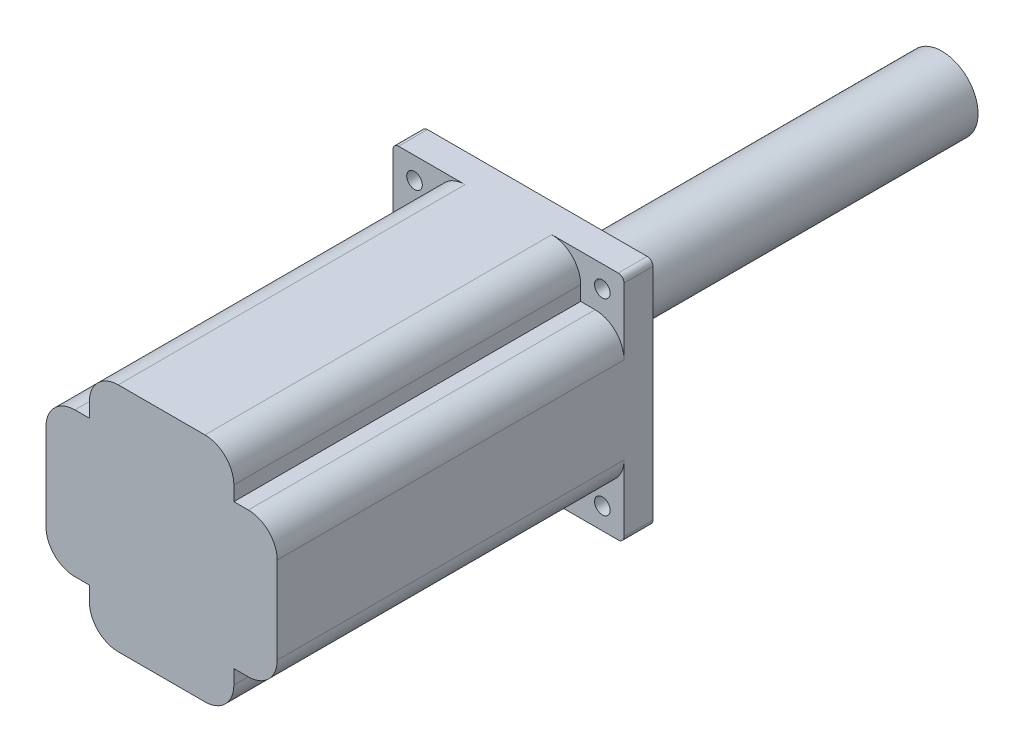
ISO-10303-21;
HEADER;
FILE_DESCRIPTION(('STEP AP214'),'2;1');
FILE_NAME('part.step','',(''),(''),'','','');
FILE_SCHEMA(('AUTOMOTIVE_DESIGN { 1 0 10303 214 1 1 1 1 }'));
ENDSEC;
DATA;
#1=APPLICATION_CONTEXT('core data for automotive mechanical design processes');
#2=APPLICATION_PROTOCOL_DEFINITION('international standard','automotive_design',2000,#1);
#3=PRODUCT_CONTEXT('',#1,'mechanical');
#4=PRODUCT('Part','Part','',(#3));
#5=PRODUCT_RELATED_PRODUCT_CATEGORY('part','',(#4));
#6=PRODUCT_DEFINITION_FORMATION('','',#4);
#7=PRODUCT_DEFINITION_CONTEXT('part definition',#1,'design');
#8=PRODUCT_DEFINITION('design','',#6,#7);
#9=PRODUCT_DEFINITION_SHAPE('','',#8);
#10=(LENGTH_UNIT() NAMED_UNIT(*) SI_UNIT(.MILLI.,.METRE.));
#11=(NAMED_UNIT(*) PLANE_ANGLE_UNIT() SI_UNIT($,.RADIAN.));
#12=(NAMED_UNIT(*) SI_UNIT($,.STERADIAN.) SOLID_ANGLE_UNIT());
#13=UNCERTAINTY_MEASURE_WITH_UNIT(LENGTH_MEASURE(1.E-05),#10,'distance_accuracy_value','');
#14=(GEOMETRIC_REPRESENTATION_CONTEXT(3) GLOBAL_UNCERTAINTY_ASSIGNED_CONTEXT((#13)) GLOBAL_UNIT_ASSIGNED_CONTEXT((#10,
#11,#12)) REPRESENTATION_CONTEXT('',''));
#15=CARTESIAN_POINT('',(0.,0.,0.));
#16=DIRECTION('',(0.,0.,1.));
#17=DIRECTION('',(1.,0.,0.));
#18=AXIS2_PLACEMENT_3D('',#15,#16,#17);
#19=CARTESIAN_POINT('',(-32.5,32.5,130.));
#20=DIRECTION('',(0.,0.,-1.));
#21=DIRECTION('',(-1.,0.,0.));
#22=AXIS2_PLACEMENT_3D('',#19,#20,#21);
#23=CYLINDRICAL_SURFACE('',#22,2.7);
#24=CARTESIAN_POINT('',(-32.5,32.5,0.));
#25=DIRECTION('',(0.,0.,1.));
#26=DIRECTION('',(1.,0.,0.));
#27=AXIS2_PLACEMENT_3D('',#24,#25,#26);
#28=CIRCLE('',#27,2.7);
#29=CARTESIAN_POINT('',(-29.8,32.5,0.));
#30=VERTEX_POINT('',#29);
#31=EDGE_CURVE('E359',#30,#30,#28,.T.);
#32=ORIENTED_EDGE('',*,*,#31,.F.);
#33=EDGE_LOOP('',(#32));
#34=FACE_BOUND('',#33,.T.);
#35=CARTESIAN_POINT('',(-32.5,32.5,9.99999999999999));
#36=DIRECTION('',(0.,0.,1.));
#37=DIRECTION('',(1.,0.,0.));
#38=AXIS2_PLACEMENT_3D('',#35,#36,#37);
#39=CIRCLE('',#38,2.7);
#40=CARTESIAN_POINT('',(-29.8,32.5,9.99999999999999));
#41=VERTEX_POINT('',#40);
#42=EDGE_CURVE('E341',#41,#41,#39,.T.);
#43=ORIENTED_EDGE('',*,*,#42,.T.);
#44=EDGE_LOOP('',(#43));
#45=FACE_BOUND('',#44,.T.);
#46=ADVANCED_FACE('F41',(#34,#45),#23,.F.);
#47=CARTESIAN_POINT('',(32.5,32.5,130.));
#48=DIRECTION('',(0.,0.,-1.));
#49=DIRECTION('',(-1.,0.,0.));
#50=AXIS2_PLACEMENT_3D('',#47,#48,#49);
#51=CYLINDRICAL_SURFACE('',#50,2.7);
#52=CARTESIAN_POINT('',(32.5,32.5,0.));
#53=DIRECTION('',(0.,0.,1.));
#54=DIRECTION('',(1.,0.,0.));
#55=AXIS2_PLACEMENT_3D('',#52,#53,#54);
#56=CIRCLE('',#55,2.7);
#57=CARTESIAN_POINT('',(35.2,32.5,0.));
#58=VERTEX_POINT('',#57);
#59=EDGE_CURVE('E355',#58,#58,#56,.T.);
#60=ORIENTED_EDGE('',*,*,#59,.F.);
#61=EDGE_LOOP('',(#60));
#62=FACE_BOUND('',#61,.T.);
#63=CARTESIAN_POINT('',(32.5,32.5,9.99999999999999));
#64=DIRECTION('',(0.,0.,1.));
#65=DIRECTION('',(1.,0.,0.));
#66=AXIS2_PLACEMENT_3D('',#63,#64,#65);
#67=CIRCLE('',#66,2.7);
#68=CARTESIAN_POINT('',(35.2,32.5,9.99999999999999));
#69=VERTEX_POINT('',#68);
#70=EDGE_CURVE('E399',#69,#69,#67,.T.);
#71=ORIENTED_EDGE('',*,*,#70,.T.);
#72=EDGE_LOOP('',(#71));
#73=FACE_BOUND('',#72,.T.);
#74=ADVANCED_FACE('F592',(#62,#73),#51,.F.);
#75=CARTESIAN_POINT('',(32.5,-32.5,130.));
#76=DIRECTION('',(0.,0.,-1.));
#77=DIRECTION('',(-1.,0.,0.));
#78=AXIS2_PLACEMENT_3D('',#75,#76,#77);
#79=CYLINDRICAL_SURFACE('',#78,2.7);
#80=CARTESIAN_POINT('',(32.5,-32.5,0.));
#81=DIRECTION('',(0.,0.,1.));
#82=DIRECTION('',(1.,0.,0.));
#83=AXIS2_PLACEMENT_3D('',#80,#81,#82);
#84=CIRCLE('',#83,2.7);
#85=CARTESIAN_POINT('',(35.2,-32.5,0.));
#86=VERTEX_POINT('',#85);
#87=EDGE_CURVE('E351',#86,#86,#84,.T.);
#88=ORIENTED_EDGE('',*,*,#87,.F.);
#89=EDGE_LOOP('',(#88));
#90=FACE_BOUND('',#89,.T.);
#91=CARTESIAN_POINT('',(32.5,-32.5,9.99999999999999));
#92=DIRECTION('',(0.,0.,1.));
#93=DIRECTION('',(1.,0.,0.));
#94=AXIS2_PLACEMENT_3D('',#91,#92,#93);
#95=CIRCLE('',#94,2.7);
#96=CARTESIAN_POINT('',(35.2,-32.5,9.99999999999999));
#97=VERTEX_POINT('',#96);
#98=EDGE_CURVE('E395',#97,#97,#95,.T.);
#99=ORIENTED_EDGE('',*,*,#98,.T.);
#100=EDGE_LOOP('',(#99));
#101=FACE_BOUND('',#100,.T.);
#102=ADVANCED_FACE('F598',(#90,#101),#79,.F.);
#103=CARTESIAN_POINT('',(-32.5,-32.5,130.));
#104=DIRECTION('',(0.,0.,-1.));
#105=DIRECTION('',(-1.,0.,0.));
#106=AXIS2_PLACEMENT_3D('',#103,#104,#105);
#107=CYLINDRICAL_SURFACE('',#106,2.7);
#108=CARTESIAN_POINT('',(-32.5,-32.5,0.));
#109=DIRECTION('',(0.,0.,1.));
#110=DIRECTION('',(1.,0.,0.));
#111=AXIS2_PLACEMENT_3D('',#108,#109,#110);
#112=CIRCLE('',#111,2.7);
#113=CARTESIAN_POINT('',(-29.8,-32.5,0.));
#114=VERTEX_POINT('',#113);
#115=EDGE_CURVE('E340',#114,#114,#112,.T.);
#116=ORIENTED_EDGE('',*,*,#115,.F.);
#117=EDGE_LOOP('',(#116));
#118=FACE_BOUND('',#117,.T.);
#119=CARTESIAN_POINT('',(-32.5,-32.5,9.99999999999999));
#120=DIRECTION('',(0.,0.,1.));
#121=DIRECTION('',(1.,0.,0.));
#122=AXIS2_PLACEMENT_3D('',#119,#120,#121);
#123=CIRCLE('',#122,2.7);
#124=CARTESIAN_POINT('',(-29.8,-32.5,9.99999999999999));
#125=VERTEX_POINT('',#124);
#126=EDGE_CURVE('E335',#125,#125,#123,.T.);
#127=ORIENTED_EDGE('',*,*,#126,.T.);
#128=EDGE_LOOP('',(#127));
#129=FACE_BOUND('',#128,.T.);
#130=ADVANCED_FACE('F608',(#118,#129),#107,.F.);
#131=CARTESIAN_POINT('',(0.,0.,130.));
#132=DIRECTION('',(0.,0.,1.));
#133=DIRECTION('',(1.,0.,0.));
#134=AXIS2_PLACEMENT_3D('',#131,#132,#133);
#135=PLANE('',#134);
#136=DIRECTION('',(0.,-1.,0.));
#137=VECTOR('',#136,1.);
#138=CARTESIAN_POINT('',(-40.,40.,130.));
#139=LINE('',#138,#137);
#140=CARTESIAN_POINT('',(-40.,15.,130.));
#141=VERTEX_POINT('',#140);
#142=CARTESIAN_POINT('',(-40.,-15.,130.));
#143=VERTEX_POINT('',#142);
#144=EDGE_CURVE('E372',#141,#143,#139,.T.);
#145=ORIENTED_EDGE('',*,*,#144,.T.);
#146=CARTESIAN_POINT('',(-30.,-15.,130.));
#147=DIRECTION('',(0.,0.,1.));
#148=DIRECTION('',(1.,0.,0.));
#149=AXIS2_PLACEMENT_3D('',#146,#147,#148);
#150=CIRCLE('',#149,10.);
#151=CARTESIAN_POINT('',(-30.,-25.,130.));
#152=VERTEX_POINT('',#151);
#153=EDGE_CURVE('E485',#143,#152,#150,.T.);
#154=ORIENTED_EDGE('',*,*,#153,.T.);
#155=DIRECTION('',(-1.,0.,0.));
#156=VECTOR('',#155,1.);
#157=CARTESIAN_POINT('',(-40.,-25.,130.));
#158=LINE('',#157,#156);
#159=CARTESIAN_POINT('',(-25.,-25.,130.));
#160=VERTEX_POINT('',#159);
#161=EDGE_CURVE('E303',#160,#152,#158,.T.);
#162=ORIENTED_EDGE('',*,*,#161,.F.);
#163=DIRECTION('',(0.,1.,0.));
#164=VECTOR('',#163,1.);
#165=CARTESIAN_POINT('',(-25.,-40.,130.));
#166=LINE('',#165,#164);
#167=CARTESIAN_POINT('',(-25.,-30.,130.));
#168=VERTEX_POINT('',#167);
#169=EDGE_CURVE('E300',#168,#160,#166,.T.);
#170=ORIENTED_EDGE('',*,*,#169,.F.);
#171=CARTESIAN_POINT('',(-15.,-30.,130.));
#172=DIRECTION('',(0.,0.,1.));
#173=DIRECTION('',(1.,0.,0.));
#174=AXIS2_PLACEMENT_3D('',#171,#172,#173);
#175=CIRCLE('',#174,10.);
#176=CARTESIAN_POINT('',(-15.,-40.,130.));
#177=VERTEX_POINT('',#176);
#178=EDGE_CURVE('E482',#168,#177,#175,.T.);
#179=ORIENTED_EDGE('',*,*,#178,.T.);
#180=DIRECTION('',(1.,0.,0.));
#181=VECTOR('',#180,1.);
#182=CARTESIAN_POINT('',(-40.,-40.,130.));
#183=LINE('',#182,#181);
#184=CARTESIAN_POINT('',(15.,-40.,130.));
#185=VERTEX_POINT('',#184);
#186=EDGE_CURVE('E347',#177,#185,#183,.T.);
#187=ORIENTED_EDGE('',*,*,#186,.T.);
#188=CARTESIAN_POINT('',(15.,-30.,130.));
#189=DIRECTION('',(0.,0.,1.));
#190=DIRECTION('',(1.,0.,0.));
#191=AXIS2_PLACEMENT_3D('',#188,#189,#190);
#192=CIRCLE('',#191,10.);
#193=CARTESIAN_POINT('',(25.,-30.,130.));
#194=VERTEX_POINT('',#193);
#195=EDGE_CURVE('E479',#185,#194,#192,.T.);
#196=ORIENTED_EDGE('',*,*,#195,.T.);
#197=DIRECTION('',(0.,-1.,0.));
#198=VECTOR('',#197,1.);
#199=CARTESIAN_POINT('',(25.,-40.,130.));
#200=LINE('',#199,#198);
#201=CARTESIAN_POINT('',(25.,-25.,130.));
#202=VERTEX_POINT('',#201);
#203=EDGE_CURVE('E278',#202,#194,#200,.T.);
#204=ORIENTED_EDGE('',*,*,#203,.F.);
#205=DIRECTION('',(-1.,0.,0.));
#206=VECTOR('',#205,1.);
#207=CARTESIAN_POINT('',(40.,-25.,130.));
#208=LINE('',#207,#206);
#209=CARTESIAN_POINT('',(30.,-25.,130.));
#210=VERTEX_POINT('',#209);
#211=EDGE_CURVE('E275',#210,#202,#208,.T.);
#212=ORIENTED_EDGE('',*,*,#211,.F.);
#213=CARTESIAN_POINT('',(30.,-15.,130.));
#214=DIRECTION('',(0.,0.,1.));
#215=DIRECTION('',(1.,0.,0.));
#216=AXIS2_PLACEMENT_3D('',#213,#214,#215);
#217=CIRCLE('',#216,10.);
#218=CARTESIAN_POINT('',(40.,-15.,130.));
#219=VERTEX_POINT('',#218);
#220=EDGE_CURVE('E476',#210,#219,#217,.T.);
#221=ORIENTED_EDGE('',*,*,#220,.T.);
#222=DIRECTION('',(0.,1.,0.));
#223=VECTOR('',#222,1.);
#224=CARTESIAN_POINT('',(40.,40.,130.));
#225=LINE('',#224,#223);
#226=CARTESIAN_POINT('',(40.,15.,130.));
#227=VERTEX_POINT('',#226);
#228=EDGE_CURVE('E364',#219,#227,#225,.T.);
#229=ORIENTED_EDGE('',*,*,#228,.T.);
#230=CARTESIAN_POINT('',(30.,15.,130.));
#231=DIRECTION('',(0.,0.,1.));
#232=DIRECTION('',(1.,0.,0.));
#233=AXIS2_PLACEMENT_3D('',#230,#231,#232);
#234=CIRCLE('',#233,10.);
#235=CARTESIAN_POINT('',(30.,25.,130.));
#236=VERTEX_POINT('',#235);
#237=EDGE_CURVE('E254',#227,#236,#234,.T.);
#238=ORIENTED_EDGE('',*,*,#237,.T.);
#239=DIRECTION('',(1.,0.,0.));
#240=VECTOR('',#239,1.);
#241=CARTESIAN_POINT('',(40.,25.,130.));
#242=LINE('',#241,#240);
#243=CARTESIAN_POINT('',(25.,25.,130.));
#244=VERTEX_POINT('',#243);
#245=EDGE_CURVE('E240',#244,#236,#242,.T.);
#246=ORIENTED_EDGE('',*,*,#245,.F.);
#247=DIRECTION('',(0.,-1.,0.));
#248=VECTOR('',#247,1.);
#249=CARTESIAN_POINT('',(25.,40.,130.));
#250=LINE('',#249,#248);
#251=CARTESIAN_POINT('',(25.,30.,130.));
#252=VERTEX_POINT('',#251);
#253=EDGE_CURVE('E229',#252,#244,#250,.T.);
#254=ORIENTED_EDGE('',*,*,#253,.F.);
#255=CARTESIAN_POINT('',(15.,30.,130.));
#256=DIRECTION('',(0.,0.,1.));
#257=DIRECTION('',(1.,0.,0.));
#258=AXIS2_PLACEMENT_3D('',#255,#256,#257);
#259=CIRCLE('',#258,10.);
#260=CARTESIAN_POINT('',(15.,40.,130.));
#261=VERTEX_POINT('',#260);
#262=EDGE_CURVE('E471',#252,#261,#259,.T.);
#263=ORIENTED_EDGE('',*,*,#262,.T.);
#264=DIRECTION('',(-1.,0.,0.));
#265=VECTOR('',#264,1.);
#266=CARTESIAN_POINT('',(-40.,40.,130.));
#267=LINE('',#266,#265);
#268=CARTESIAN_POINT('',(-15.,40.,130.));
#269=VERTEX_POINT('',#268);
#270=EDGE_CURVE('E367',#261,#269,#267,.T.);
#271=ORIENTED_EDGE('',*,*,#270,.T.);
#272=CARTESIAN_POINT('',(-15.,30.,130.));
#273=DIRECTION('',(0.,0.,1.));
#274=DIRECTION('',(1.,0.,0.));
#275=AXIS2_PLACEMENT_3D('',#272,#273,#274);
#276=CIRCLE('',#275,10.);
#277=CARTESIAN_POINT('',(-25.,30.,130.));
#278=VERTEX_POINT('',#277);
#279=EDGE_CURVE('E465',#269,#278,#276,.T.);
#280=ORIENTED_EDGE('',*,*,#279,.T.);
#281=DIRECTION('',(0.,1.,0.));
#282=VECTOR('',#281,1.);
#283=CARTESIAN_POINT('',(-25.,40.,130.));
#284=LINE('',#283,#282);
#285=CARTESIAN_POINT('',(-25.,25.,130.));
#286=VERTEX_POINT('',#285);
#287=EDGE_CURVE('E327',#286,#278,#284,.T.);
#288=ORIENTED_EDGE('',*,*,#287,.F.);
#289=DIRECTION('',(1.,0.,0.));
#290=VECTOR('',#289,1.);
#291=CARTESIAN_POINT('',(-40.,25.,130.));
#292=LINE('',#291,#290);
#293=CARTESIAN_POINT('',(-30.,25.,130.));
#294=VERTEX_POINT('',#293);
#295=EDGE_CURVE('E262',#294,#286,#292,.T.);
#296=ORIENTED_EDGE('',*,*,#295,.F.);
#297=CARTESIAN_POINT('',(-30.,15.,130.));
#298=DIRECTION('',(0.,0.,1.));
#299=DIRECTION('',(1.,0.,0.));
#300=AXIS2_PLACEMENT_3D('',#297,#298,#299);
#301=CIRCLE('',#300,10.);
#302=EDGE_CURVE('E468',#294,#141,#301,.T.);
#303=ORIENTED_EDGE('',*,*,#302,.T.);
#304=EDGE_LOOP('',(#145,#154,#162,#170,#179,#187,#196,#204,#212,#221,#229,#238,#246,#254,#263,
#271,#280,#288,#296,#303));
#305=FACE_BOUND('',#304,.T.);
#306=ADVANCED_FACE('F252',(#305),#135,.T.);
#307=CARTESIAN_POINT('',(0.,0.,0.));
#308=DIRECTION('',(0.,0.,1.));
#309=DIRECTION('',(1.,0.,0.));
#310=AXIS2_PLACEMENT_3D('',#307,#308,#309);
#311=PLANE('',#310);
#312=CARTESIAN_POINT('',(0.,0.,0.));
#313=DIRECTION('',(0.,0.,-1.));
#314=DIRECTION('',(-1.,0.,0.));
#315=AXIS2_PLACEMENT_3D('',#312,#313,#314);
#316=CIRCLE('',#315,12.5);
#317=CARTESIAN_POINT('',(-12.5,0.,0.));
#318=VERTEX_POINT('',#317);
#319=EDGE_CURVE('E342',#318,#318,#316,.T.);
#320=ORIENTED_EDGE('',*,*,#319,.F.);
#321=EDGE_LOOP('',(#320));
#322=FACE_BOUND('',#321,.T.);
#323=DIRECTION('',(-1.,0.,0.));
#324=VECTOR('',#323,1.);
#325=CARTESIAN_POINT('',(-40.,40.,0.));
#326=LINE('',#325,#324);
#327=CARTESIAN_POINT('',(38.,40.,0.));
#328=VERTEX_POINT('',#327);
#329=CARTESIAN_POINT('',(-38.,40.,0.));
#330=VERTEX_POINT('',#329);
#331=EDGE_CURVE('E381',#328,#330,#326,.T.);
#332=ORIENTED_EDGE('',*,*,#331,.F.);
#333=CARTESIAN_POINT('',(38.,38.,0.));
#334=DIRECTION('',(0.,0.,1.));
#335=DIRECTION('',(1.,0.,0.));
#336=AXIS2_PLACEMENT_3D('',#333,#334,#335);
#337=CIRCLE('',#336,2.);
#338=CARTESIAN_POINT('',(40.,38.,0.));
#339=VERTEX_POINT('',#338);
#340=EDGE_CURVE('E421',#328,#339,#337,.F.);
#341=ORIENTED_EDGE('',*,*,#340,.T.);
#342=DIRECTION('',(0.,1.,0.));
#343=VECTOR('',#342,1.);
#344=CARTESIAN_POINT('',(40.,40.,0.));
#345=LINE('',#344,#343);
#346=CARTESIAN_POINT('',(40.,-38.,0.));
#347=VERTEX_POINT('',#346);
#348=EDGE_CURVE('E363',#347,#339,#345,.T.);
#349=ORIENTED_EDGE('',*,*,#348,.F.);
#350=CARTESIAN_POINT('',(38.,-38.,0.));
#351=DIRECTION('',(0.,0.,1.));
#352=DIRECTION('',(1.,0.,0.));
#353=AXIS2_PLACEMENT_3D('',#350,#351,#352);
#354=CIRCLE('',#353,2.);
#355=CARTESIAN_POINT('',(38.,-40.,0.));
#356=VERTEX_POINT('',#355);
#357=EDGE_CURVE('E418',#347,#356,#354,.F.);
#358=ORIENTED_EDGE('',*,*,#357,.T.);
#359=DIRECTION('',(1.,0.,0.));
#360=VECTOR('',#359,1.);
#361=CARTESIAN_POINT('',(-40.,-40.,0.));
#362=LINE('',#361,#360);
#363=CARTESIAN_POINT('',(-38.,-40.,0.));
#364=VERTEX_POINT('',#363);
#365=EDGE_CURVE('E368',#364,#356,#362,.T.);
#366=ORIENTED_EDGE('',*,*,#365,.F.);
#367=CARTESIAN_POINT('',(-38.,-38.,0.));
#368=DIRECTION('',(0.,0.,1.));
#369=DIRECTION('',(1.,0.,0.));
#370=AXIS2_PLACEMENT_3D('',#367,#368,#369);
#371=CIRCLE('',#370,2.);
#372=CARTESIAN_POINT('',(-40.,-38.,0.));
#373=VERTEX_POINT('',#372);
#374=EDGE_CURVE('E412',#364,#373,#371,.F.);
#375=ORIENTED_EDGE('',*,*,#374,.T.);
#376=DIRECTION('',(0.,-1.,0.));
#377=VECTOR('',#376,1.);
#378=CARTESIAN_POINT('',(-40.,40.,0.));
#379=LINE('',#378,#377);
#380=CARTESIAN_POINT('',(-40.,38.,0.));
#381=VERTEX_POINT('',#380);
#382=EDGE_CURVE('E385',#381,#373,#379,.T.);
#383=ORIENTED_EDGE('',*,*,#382,.F.);
#384=CARTESIAN_POINT('',(-38.,38.,0.));
#385=DIRECTION('',(0.,0.,1.));
#386=DIRECTION('',(1.,0.,0.));
#387=AXIS2_PLACEMENT_3D('',#384,#385,#386);
#388=CIRCLE('',#387,2.);
#389=EDGE_CURVE('E415',#381,#330,#388,.F.);
#390=ORIENTED_EDGE('',*,*,#389,.T.);
#391=EDGE_LOOP('',(#332,#341,#349,#358,#366,#375,#383,#390));
#392=FACE_BOUND('',#391,.T.);
#393=ORIENTED_EDGE('',*,*,#31,.T.);
#394=EDGE_LOOP('',(#393));
#395=FACE_BOUND('',#394,.T.);
#396=ORIENTED_EDGE('',*,*,#59,.T.);
#397=EDGE_LOOP('',(#396));
#398=FACE_BOUND('',#397,.T.);
#399=ORIENTED_EDGE('',*,*,#87,.T.);
#400=EDGE_LOOP('',(#399));
#401=FACE_BOUND('',#400,.T.);
#402=ORIENTED_EDGE('',*,*,#115,.T.);
#403=EDGE_LOOP('',(#402));
#404=FACE_BOUND('',#403,.T.);
#405=ADVANCED_FACE('F607',(#322,#392,#395,#398,#401,#404),#311,.F.);
#406=CARTESIAN_POINT('',(40.,40.,130.));
#407=DIRECTION('',(-1.,0.,0.));
#408=DIRECTION('',(0.,0.,1.));
#409=AXIS2_PLACEMENT_3D('',#406,#407,#408);
#410=PLANE('',#409);
#411=ORIENTED_EDGE('',*,*,#228,.F.);
#412=DIRECTION('',(0.,0.,1.));
#413=VECTOR('',#412,1.);
#414=CARTESIAN_POINT('',(40.,-15.,130.));
#415=LINE('',#414,#413);
#416=CARTESIAN_POINT('',(40.,-15.,10.));
#417=VERTEX_POINT('',#416);
#418=EDGE_CURVE('E514',#219,#417,#415,.F.);
#419=ORIENTED_EDGE('',*,*,#418,.T.);
#420=DIRECTION('',(0.,-1.,0.));
#421=VECTOR('',#420,1.);
#422=CARTESIAN_POINT('',(40.,-40.,10.));
#423=LINE('',#422,#421);
#424=CARTESIAN_POINT('',(40.,-38.,10.));
#425=VERTEX_POINT('',#424);
#426=EDGE_CURVE('E271',#417,#425,#423,.T.);
#427=ORIENTED_EDGE('',*,*,#426,.T.);
#428=DIRECTION('',(0.,0.,-1.));
#429=VECTOR('',#428,1.);
#430=CARTESIAN_POINT('',(40.,-38.,130.));
#431=LINE('',#430,#429);
#432=EDGE_CURVE('E424',#425,#347,#431,.T.);
#433=ORIENTED_EDGE('',*,*,#432,.T.);
#434=ORIENTED_EDGE('',*,*,#348,.T.);
#435=DIRECTION('',(0.,0.,-1.));
#436=VECTOR('',#435,1.);
#437=CARTESIAN_POINT('',(40.,38.,130.));
#438=LINE('',#437,#436);
#439=CARTESIAN_POINT('',(40.,38.,10.));
#440=VERTEX_POINT('',#439);
#441=EDGE_CURVE('E428',#339,#440,#438,.F.);
#442=ORIENTED_EDGE('',*,*,#441,.T.);
#443=DIRECTION('',(0.,-1.,0.));
#444=VECTOR('',#443,1.);
#445=CARTESIAN_POINT('',(40.,40.,10.));
#446=LINE('',#445,#444);
#447=CARTESIAN_POINT('',(40.,15.,10.));
#448=VERTEX_POINT('',#447);
#449=EDGE_CURVE('E561',#440,#448,#446,.T.);
#450=ORIENTED_EDGE('',*,*,#449,.T.);
#451=DIRECTION('',(0.,0.,1.));
#452=VECTOR('',#451,1.);
#453=CARTESIAN_POINT('',(40.,15.,130.));
#454=LINE('',#453,#452);
#455=EDGE_CURVE('E510',#448,#227,#454,.T.);
#456=ORIENTED_EDGE('',*,*,#455,.T.);
#457=EDGE_LOOP('',(#411,#419,#427,#433,#434,#442,#450,#456));
#458=FACE_BOUND('',#457,.T.);
#459=ADVANCED_FACE('F568',(#458),#410,.F.);
#460=CARTESIAN_POINT('',(-40.,40.,130.));
#461=DIRECTION('',(0.,-1.,0.));
#462=DIRECTION('',(0.,0.,-1.));
#463=AXIS2_PLACEMENT_3D('',#460,#461,#462);
#464=PLANE('',#463);
#465=ORIENTED_EDGE('',*,*,#270,.F.);
#466=DIRECTION('',(0.,0.,1.));
#467=VECTOR('',#466,1.);
#468=CARTESIAN_POINT('',(15.,40.,130.));
#469=LINE('',#468,#467);
#470=CARTESIAN_POINT('',(15.,40.,10.));
#471=VERTEX_POINT('',#470);
#472=EDGE_CURVE('E527',#261,#471,#469,.F.);
#473=ORIENTED_EDGE('',*,*,#472,.T.);
#474=DIRECTION('',(1.,0.,0.));
#475=VECTOR('',#474,1.);
#476=CARTESIAN_POINT('',(40.,40.,10.));
#477=LINE('',#476,#475);
#478=CARTESIAN_POINT('',(38.,40.,10.));
#479=VERTEX_POINT('',#478);
#480=EDGE_CURVE('E263',#471,#479,#477,.T.);
#481=ORIENTED_EDGE('',*,*,#480,.T.);
#482=DIRECTION('',(0.,0.,-1.));
#483=VECTOR('',#482,1.);
#484=CARTESIAN_POINT('',(38.,40.,130.));
#485=LINE('',#484,#483);
#486=EDGE_CURVE('E408',#479,#328,#485,.T.);
#487=ORIENTED_EDGE('',*,*,#486,.T.);
#488=ORIENTED_EDGE('',*,*,#331,.T.);
#489=DIRECTION('',(0.,0.,-1.));
#490=VECTOR('',#489,1.);
#491=CARTESIAN_POINT('',(-38.,40.,130.));
#492=LINE('',#491,#490);
#493=CARTESIAN_POINT('',(-38.,40.,10.));
#494=VERTEX_POINT('',#493);
#495=EDGE_CURVE('E346',#330,#494,#492,.F.);
#496=ORIENTED_EDGE('',*,*,#495,.T.);
#497=DIRECTION('',(1.,0.,0.));
#498=VECTOR('',#497,1.);
#499=CARTESIAN_POINT('',(-40.,40.,10.));
#500=LINE('',#499,#498);
#501=CARTESIAN_POINT('',(-15.,40.,10.));
#502=VERTEX_POINT('',#501);
#503=EDGE_CURVE('E316',#494,#502,#500,.T.);
#504=ORIENTED_EDGE('',*,*,#503,.T.);
#505=DIRECTION('',(0.,0.,1.));
#506=VECTOR('',#505,1.);
#507=CARTESIAN_POINT('',(-15.,40.,130.));
#508=LINE('',#507,#506);
#509=EDGE_CURVE('E523',#502,#269,#508,.T.);
#510=ORIENTED_EDGE('',*,*,#509,.T.);
#511=EDGE_LOOP('',(#465,#473,#481,#487,#488,#496,#504,#510));
#512=FACE_BOUND('',#511,.T.);
#513=ADVANCED_FACE('F620',(#512),#464,.F.);
#514=CARTESIAN_POINT('',(-40.,40.,130.));
#515=DIRECTION('',(1.,0.,0.));
#516=DIRECTION('',(0.,1.,0.));
#517=AXIS2_PLACEMENT_3D('',#514,#515,#516);
#518=PLANE('',#517);
#519=DIRECTION('',(0.,1.,0.));
#520=VECTOR('',#519,1.);
#521=CARTESIAN_POINT('',(-40.,-40.,10.));
#522=LINE('',#521,#520);
#523=CARTESIAN_POINT('',(-40.,-38.,10.));
#524=VERTEX_POINT('',#523);
#525=CARTESIAN_POINT('',(-40.,-15.,10.));
#526=VERTEX_POINT('',#525);
#527=EDGE_CURVE('E292',#524,#526,#522,.T.);
#528=ORIENTED_EDGE('',*,*,#527,.T.);
#529=DIRECTION('',(0.,0.,1.));
#530=VECTOR('',#529,1.);
#531=CARTESIAN_POINT('',(-40.,-15.,130.));
#532=LINE('',#531,#530);
#533=EDGE_CURVE('E461',#526,#143,#532,.T.);
#534=ORIENTED_EDGE('',*,*,#533,.T.);
#535=ORIENTED_EDGE('',*,*,#144,.F.);
#536=DIRECTION('',(0.,0.,1.));
#537=VECTOR('',#536,1.);
#538=CARTESIAN_POINT('',(-40.,15.,130.));
#539=LINE('',#538,#537);
#540=CARTESIAN_POINT('',(-40.,15.,10.));
#541=VERTEX_POINT('',#540);
#542=EDGE_CURVE('E457',#141,#541,#539,.F.);
#543=ORIENTED_EDGE('',*,*,#542,.T.);
#544=DIRECTION('',(0.,1.,0.));
#545=VECTOR('',#544,1.);
#546=CARTESIAN_POINT('',(-40.,40.,10.));
#547=LINE('',#546,#545);
#548=CARTESIAN_POINT('',(-40.,38.,10.));
#549=VERTEX_POINT('',#548);
#550=EDGE_CURVE('E320',#541,#549,#547,.T.);
#551=ORIENTED_EDGE('',*,*,#550,.T.);
#552=DIRECTION('',(0.,0.,-1.));
#553=VECTOR('',#552,1.);
#554=CARTESIAN_POINT('',(-40.,38.,130.));
#555=LINE('',#554,#553);
#556=EDGE_CURVE('E447',#549,#381,#555,.T.);
#557=ORIENTED_EDGE('',*,*,#556,.T.);
#558=ORIENTED_EDGE('',*,*,#382,.T.);
#559=DIRECTION('',(0.,0.,-1.));
#560=VECTOR('',#559,1.);
#561=CARTESIAN_POINT('',(-40.,-38.,130.));
#562=LINE('',#561,#560);
#563=EDGE_CURVE('E444',#373,#524,#562,.F.);
#564=ORIENTED_EDGE('',*,*,#563,.T.);
#565=EDGE_LOOP('',(#528,#534,#535,#543,#551,#557,#558,#564));
#566=FACE_BOUND('',#565,.T.);
#567=ADVANCED_FACE('F616',(#566),#518,.F.);
#568=CARTESIAN_POINT('',(-40.,-40.,130.));
#569=DIRECTION('',(0.,1.,0.));
#570=DIRECTION('',(0.,0.,1.));
#571=AXIS2_PLACEMENT_3D('',#568,#569,#570);
#572=PLANE('',#571);
#573=ORIENTED_EDGE('',*,*,#186,.F.);
#574=DIRECTION('',(0.,0.,1.));
#575=VECTOR('',#574,1.);
#576=CARTESIAN_POINT('',(-15.,-40.,130.));
#577=LINE('',#576,#575);
#578=CARTESIAN_POINT('',(-15.,-40.,10.));
#579=VERTEX_POINT('',#578);
#580=EDGE_CURVE('E499',#177,#579,#577,.F.);
#581=ORIENTED_EDGE('',*,*,#580,.T.);
#582=DIRECTION('',(-1.,0.,0.));
#583=VECTOR('',#582,1.);
#584=CARTESIAN_POINT('',(-40.,-40.,10.));
#585=LINE('',#584,#583);
#586=CARTESIAN_POINT('',(-38.,-40.,10.));
#587=VERTEX_POINT('',#586);
#588=EDGE_CURVE('E296',#579,#587,#585,.T.);
#589=ORIENTED_EDGE('',*,*,#588,.T.);
#590=DIRECTION('',(0.,0.,-1.));
#591=VECTOR('',#590,1.);
#592=CARTESIAN_POINT('',(-38.,-40.,130.));
#593=LINE('',#592,#591);
#594=EDGE_CURVE('E434',#587,#364,#593,.T.);
#595=ORIENTED_EDGE('',*,*,#594,.T.);
#596=ORIENTED_EDGE('',*,*,#365,.T.);
#597=DIRECTION('',(0.,0.,-1.));
#598=VECTOR('',#597,1.);
#599=CARTESIAN_POINT('',(38.,-40.,130.));
#600=LINE('',#599,#598);
#601=CARTESIAN_POINT('',(38.,-40.,10.));
#602=VERTEX_POINT('',#601);
#603=EDGE_CURVE('E438',#356,#602,#600,.F.);
#604=ORIENTED_EDGE('',*,*,#603,.T.);
#605=DIRECTION('',(-1.,0.,0.));
#606=VECTOR('',#605,1.);
#607=CARTESIAN_POINT('',(40.,-40.,10.));
#608=LINE('',#607,#606);
#609=CARTESIAN_POINT('',(15.,-40.,10.));
#610=VERTEX_POINT('',#609);
#611=EDGE_CURVE('E267',#602,#610,#608,.T.);
#612=ORIENTED_EDGE('',*,*,#611,.T.);
#613=DIRECTION('',(0.,0.,1.));
#614=VECTOR('',#613,1.);
#615=CARTESIAN_POINT('',(15.,-40.,130.));
#616=LINE('',#615,#614);
#617=EDGE_CURVE('E495',#610,#185,#616,.T.);
#618=ORIENTED_EDGE('',*,*,#617,.T.);
#619=EDGE_LOOP('',(#573,#581,#589,#595,#596,#604,#612,#618));
#620=FACE_BOUND('',#619,.T.);
#621=ADVANCED_FACE('F612',(#620),#572,.F.);
#622=CARTESIAN_POINT('',(0.,0.,-140.));
#623=DIRECTION('',(0.,0.,1.));
#624=DIRECTION('',(1.,0.,0.));
#625=AXIS2_PLACEMENT_3D('',#622,#623,#624);
#626=CYLINDRICAL_SURFACE('',#625,12.5);
#627=CARTESIAN_POINT('',(0.,0.,-140.));
#628=DIRECTION('',(0.,0.,-1.));
#629=DIRECTION('',(-1.,0.,0.));
#630=AXIS2_PLACEMENT_3D('',#627,#628,#629);
#631=CIRCLE('',#630,12.5);
#632=CARTESIAN_POINT('',(-12.5,0.,-140.));
#633=VERTEX_POINT('',#632);
#634=EDGE_CURVE('E336',#633,#633,#631,.T.);
#635=ORIENTED_EDGE('',*,*,#634,.F.);
#636=EDGE_LOOP('',(#635));
#637=FACE_BOUND('',#636,.T.);
#638=ORIENTED_EDGE('',*,*,#319,.T.);
#639=EDGE_LOOP('',(#638));
#640=FACE_BOUND('',#639,.T.);
#641=ADVANCED_FACE('F615',(#637,#640),#626,.T.);
#642=CARTESIAN_POINT('',(0.,0.,-140.));
#643=DIRECTION('',(0.,0.,-1.));
#644=DIRECTION('',(-1.,0.,0.));
#645=AXIS2_PLACEMENT_3D('',#642,#643,#644);
#646=PLANE('',#645);
#647=ORIENTED_EDGE('',*,*,#634,.T.);
#648=EDGE_LOOP('',(#647));
#649=FACE_BOUND('',#648,.T.);
#650=ADVANCED_FACE('F866',(#649),#646,.T.);
#651=CARTESIAN_POINT('',(-40.,-25.,-21.2132034355965));
#652=DIRECTION('',(0.,1.,0.));
#653=DIRECTION('',(-1.,0.,0.));
#654=AXIS2_PLACEMENT_3D('',#651,#652,#653);
#655=PLANE('',#654);
#656=ORIENTED_EDGE('',*,*,#161,.T.);
#657=DIRECTION('',(0.,0.,1.));
#658=VECTOR('',#657,1.);
#659=CARTESIAN_POINT('',(-30.,-25.,-21.2132034355965));
#660=LINE('',#659,#658);
#661=CARTESIAN_POINT('',(-30.,-25.,10.));
#662=VERTEX_POINT('',#661);
#663=EDGE_CURVE('E488',#152,#662,#660,.F.);
#664=ORIENTED_EDGE('',*,*,#663,.T.);
#665=DIRECTION('',(1.,0.,0.));
#666=VECTOR('',#665,1.);
#667=CARTESIAN_POINT('',(-40.,-25.,10.));
#668=LINE('',#667,#666);
#669=CARTESIAN_POINT('',(-25.,-25.,10.));
#670=VERTEX_POINT('',#669);
#671=EDGE_CURVE('E289',#662,#670,#668,.T.);
#672=ORIENTED_EDGE('',*,*,#671,.T.);
#673=DIRECTION('',(0.,0.,1.));
#674=VECTOR('',#673,1.);
#675=CARTESIAN_POINT('',(-25.,-25.,-21.2132034355965));
#676=LINE('',#675,#674);
#677=EDGE_CURVE('E293',#670,#160,#676,.T.);
#678=ORIENTED_EDGE('',*,*,#677,.T.);
#679=EDGE_LOOP('',(#656,#664,#672,#678));
#680=FACE_BOUND('',#679,.T.);
#681=ADVANCED_FACE('F856',(#680),#655,.F.);
#682=CARTESIAN_POINT('',(-25.,-40.,-21.2132034355965));
#683=DIRECTION('',(1.,0.,0.));
#684=DIRECTION('',(0.,1.,0.));
#685=AXIS2_PLACEMENT_3D('',#682,#683,#684);
#686=PLANE('',#685);
#687=DIRECTION('',(0.,-1.,0.));
#688=VECTOR('',#687,1.);
#689=CARTESIAN_POINT('',(-25.,-40.,10.));
#690=LINE('',#689,#688);
#691=CARTESIAN_POINT('',(-25.,-30.,10.));
#692=VERTEX_POINT('',#691);
#693=EDGE_CURVE('E279',#670,#692,#690,.T.);
#694=ORIENTED_EDGE('',*,*,#693,.T.);
#695=DIRECTION('',(0.,0.,1.));
#696=VECTOR('',#695,1.);
#697=CARTESIAN_POINT('',(-25.,-30.,-21.2132034355965));
#698=LINE('',#697,#696);
#699=EDGE_CURVE('E491',#692,#168,#698,.T.);
#700=ORIENTED_EDGE('',*,*,#699,.T.);
#701=ORIENTED_EDGE('',*,*,#169,.T.);
#702=ORIENTED_EDGE('',*,*,#677,.F.);
#703=EDGE_LOOP('',(#694,#700,#701,#702));
#704=FACE_BOUND('',#703,.T.);
#705=ADVANCED_FACE('F846',(#704),#686,.F.);
#706=CARTESIAN_POINT('',(0.,0.,10.));
#707=DIRECTION('',(0.,0.,1.));
#708=DIRECTION('',(1.,0.,0.));
#709=AXIS2_PLACEMENT_3D('',#706,#707,#708);
#710=PLANE('',#709);
#711=ORIENTED_EDGE('',*,*,#126,.F.);
#712=EDGE_LOOP('',(#711));
#713=FACE_BOUND('',#712,.T.);
#714=ORIENTED_EDGE('',*,*,#527,.F.);
#715=CARTESIAN_POINT('',(-38.,-38.,9.99999999999999));
#716=DIRECTION('',(0.,0.,1.));
#717=DIRECTION('',(1.,0.,0.));
#718=AXIS2_PLACEMENT_3D('',#715,#716,#717);
#719=CIRCLE('',#718,2.);
#720=EDGE_CURVE('E454',#524,#587,#719,.T.);
#721=ORIENTED_EDGE('',*,*,#720,.T.);
#722=ORIENTED_EDGE('',*,*,#588,.F.);
#723=CARTESIAN_POINT('',(-15.,-30.,10.));
#724=DIRECTION('',(0.,0.,1.));
#725=DIRECTION('',(1.,0.,0.));
#726=AXIS2_PLACEMENT_3D('',#723,#724,#725);
#727=CIRCLE('',#726,10.);
#728=EDGE_CURVE('E541',#579,#692,#727,.F.);
#729=ORIENTED_EDGE('',*,*,#728,.T.);
#730=ORIENTED_EDGE('',*,*,#693,.F.);
#731=ORIENTED_EDGE('',*,*,#671,.F.);
#732=CARTESIAN_POINT('',(-30.,-15.,9.99999999999999));
#733=DIRECTION('',(0.,0.,1.));
#734=DIRECTION('',(1.,0.,0.));
#735=AXIS2_PLACEMENT_3D('',#732,#733,#734);
#736=CIRCLE('',#735,10.);
#737=EDGE_CURVE('E537',#662,#526,#736,.F.);
#738=ORIENTED_EDGE('',*,*,#737,.T.);
#739=EDGE_LOOP('',(#714,#721,#722,#729,#730,#731,#738));
#740=FACE_BOUND('',#739,.T.);
#741=ADVANCED_FACE('F709',(#713,#740),#710,.T.);
#742=CARTESIAN_POINT('',(25.,-40.,-21.2132034355965));
#743=DIRECTION('',(-1.,0.,0.));
#744=DIRECTION('',(0.,0.,1.));
#745=AXIS2_PLACEMENT_3D('',#742,#743,#744);
#746=PLANE('',#745);
#747=ORIENTED_EDGE('',*,*,#203,.T.);
#748=DIRECTION('',(0.,0.,1.));
#749=VECTOR('',#748,1.);
#750=CARTESIAN_POINT('',(25.,-30.,-21.2132034355965));
#751=LINE('',#750,#749);
#752=CARTESIAN_POINT('',(25.,-30.,10.));
#753=VERTEX_POINT('',#752);
#754=EDGE_CURVE('E503',#194,#753,#751,.F.);
#755=ORIENTED_EDGE('',*,*,#754,.T.);
#756=DIRECTION('',(0.,1.,0.));
#757=VECTOR('',#756,1.);
#758=CARTESIAN_POINT('',(25.,-40.,10.));
#759=LINE('',#758,#757);
#760=CARTESIAN_POINT('',(25.,-25.,10.));
#761=VERTEX_POINT('',#760);
#762=EDGE_CURVE('E264',#753,#761,#759,.T.);
#763=ORIENTED_EDGE('',*,*,#762,.T.);
#764=DIRECTION('',(0.,0.,1.));
#765=VECTOR('',#764,1.);
#766=CARTESIAN_POINT('',(25.,-25.,-21.2132034355965));
#767=LINE('',#766,#765);
#768=EDGE_CURVE('E268',#761,#202,#767,.T.);
#769=ORIENTED_EDGE('',*,*,#768,.T.);
#770=EDGE_LOOP('',(#747,#755,#763,#769));
#771=FACE_BOUND('',#770,.T.);
#772=ADVANCED_FACE('F667',(#771),#746,.F.);
#773=CARTESIAN_POINT('',(40.,-25.,-21.2132034355965));
#774=DIRECTION('',(0.,1.,0.));
#775=DIRECTION('',(-1.,0.,0.));
#776=AXIS2_PLACEMENT_3D('',#773,#774,#775);
#777=PLANE('',#776);
#778=DIRECTION('',(1.,0.,0.));
#779=VECTOR('',#778,1.);
#780=CARTESIAN_POINT('',(40.,-25.,10.));
#781=LINE('',#780,#779);
#782=CARTESIAN_POINT('',(30.,-25.,10.));
#783=VERTEX_POINT('',#782);
#784=EDGE_CURVE('E241',#761,#783,#781,.T.);
#785=ORIENTED_EDGE('',*,*,#784,.T.);
#786=DIRECTION('',(0.,0.,1.));
#787=VECTOR('',#786,1.);
#788=CARTESIAN_POINT('',(30.,-25.,-21.2132034355965));
#789=LINE('',#788,#787);
#790=EDGE_CURVE('E506',#783,#210,#789,.T.);
#791=ORIENTED_EDGE('',*,*,#790,.T.);
#792=ORIENTED_EDGE('',*,*,#211,.T.);
#793=ORIENTED_EDGE('',*,*,#768,.F.);
#794=EDGE_LOOP('',(#785,#791,#792,#793));
#795=FACE_BOUND('',#794,.T.);
#796=ADVANCED_FACE('F670',(#795),#777,.F.);
#797=CARTESIAN_POINT('',(0.,0.,10.));
#798=DIRECTION('',(0.,0.,1.));
#799=DIRECTION('',(1.,0.,0.));
#800=AXIS2_PLACEMENT_3D('',#797,#798,#799);
#801=PLANE('',#800);
#802=ORIENTED_EDGE('',*,*,#98,.F.);
#803=EDGE_LOOP('',(#802));
#804=FACE_BOUND('',#803,.T.);
#805=ORIENTED_EDGE('',*,*,#611,.F.);
#806=CARTESIAN_POINT('',(38.,-38.,9.99999999999999));
#807=DIRECTION('',(0.,0.,1.));
#808=DIRECTION('',(1.,0.,0.));
#809=AXIS2_PLACEMENT_3D('',#806,#807,#808);
#810=CIRCLE('',#809,2.);
#811=EDGE_CURVE('E441',#602,#425,#810,.T.);
#812=ORIENTED_EDGE('',*,*,#811,.T.);
#813=ORIENTED_EDGE('',*,*,#426,.F.);
#814=CARTESIAN_POINT('',(30.,-15.,10.));
#815=DIRECTION('',(0.,0.,1.));
#816=DIRECTION('',(1.,0.,0.));
#817=AXIS2_PLACEMENT_3D('',#814,#815,#816);
#818=CIRCLE('',#817,10.);
#819=EDGE_CURVE('E548',#417,#783,#818,.F.);
#820=ORIENTED_EDGE('',*,*,#819,.T.);
#821=ORIENTED_EDGE('',*,*,#784,.F.);
#822=ORIENTED_EDGE('',*,*,#762,.F.);
#823=CARTESIAN_POINT('',(15.,-30.,9.99999999999999));
#824=DIRECTION('',(0.,0.,1.));
#825=DIRECTION('',(1.,0.,0.));
#826=AXIS2_PLACEMENT_3D('',#823,#824,#825);
#827=CIRCLE('',#826,10.);
#828=EDGE_CURVE('E544',#753,#610,#827,.F.);
#829=ORIENTED_EDGE('',*,*,#828,.T.);
#830=EDGE_LOOP('',(#805,#812,#813,#820,#821,#822,#829));
#831=FACE_BOUND('',#830,.T.);
#832=ADVANCED_FACE('F662',(#804,#831),#801,.T.);
#833=CARTESIAN_POINT('',(40.,25.,-21.2132034355965));
#834=DIRECTION('',(0.,-1.,0.));
#835=DIRECTION('',(1.,0.,0.));
#836=AXIS2_PLACEMENT_3D('',#833,#834,#835);
#837=PLANE('',#836);
#838=ORIENTED_EDGE('',*,*,#245,.T.);
#839=DIRECTION('',(0.,0.,1.));
#840=VECTOR('',#839,1.);
#841=CARTESIAN_POINT('',(30.,25.,-21.2132034355965));
#842=LINE('',#841,#840);
#843=CARTESIAN_POINT('',(30.,25.,10.));
#844=VERTEX_POINT('',#843);
#845=EDGE_CURVE('E518',#236,#844,#842,.F.);
#846=ORIENTED_EDGE('',*,*,#845,.T.);
#847=DIRECTION('',(-1.,0.,0.));
#848=VECTOR('',#847,1.);
#849=CARTESIAN_POINT('',(40.,25.,10.));
#850=LINE('',#849,#848);
#851=CARTESIAN_POINT('',(25.,25.,10.));
#852=VERTEX_POINT('',#851);
#853=EDGE_CURVE('E248',#844,#852,#850,.T.);
#854=ORIENTED_EDGE('',*,*,#853,.T.);
#855=DIRECTION('',(0.,0.,1.));
#856=VECTOR('',#855,1.);
#857=CARTESIAN_POINT('',(25.,25.,-21.2132034355965));
#858=LINE('',#857,#856);
#859=EDGE_CURVE('E233',#852,#244,#858,.T.);
#860=ORIENTED_EDGE('',*,*,#859,.T.);
#861=EDGE_LOOP('',(#838,#846,#854,#860));
#862=FACE_BOUND('',#861,.T.);
#863=ADVANCED_FACE('F245',(#862),#837,.F.);
#864=CARTESIAN_POINT('',(25.,40.,-21.2132034355965));
#865=DIRECTION('',(-1.,0.,0.));
#866=DIRECTION('',(0.,0.,1.));
#867=AXIS2_PLACEMENT_3D('',#864,#865,#866);
#868=PLANE('',#867);
#869=DIRECTION('',(0.,1.,0.));
#870=VECTOR('',#869,1.);
#871=CARTESIAN_POINT('',(25.,40.,10.));
#872=LINE('',#871,#870);
#873=CARTESIAN_POINT('',(25.,30.,10.));
#874=VERTEX_POINT('',#873);
#875=EDGE_CURVE('E259',#852,#874,#872,.T.);
#876=ORIENTED_EDGE('',*,*,#875,.T.);
#877=DIRECTION('',(0.,0.,1.));
#878=VECTOR('',#877,1.);
#879=CARTESIAN_POINT('',(25.,30.,-21.2132034355965));
#880=LINE('',#879,#878);
#881=EDGE_CURVE('E236',#874,#252,#880,.T.);
#882=ORIENTED_EDGE('',*,*,#881,.T.);
#883=ORIENTED_EDGE('',*,*,#253,.T.);
#884=ORIENTED_EDGE('',*,*,#859,.F.);
#885=EDGE_LOOP('',(#876,#882,#883,#884));
#886=FACE_BOUND('',#885,.T.);
#887=ADVANCED_FACE('F232',(#886),#868,.F.);
#888=CARTESIAN_POINT('',(0.,0.,10.));
#889=DIRECTION('',(0.,0.,1.));
#890=DIRECTION('',(1.,0.,0.));
#891=AXIS2_PLACEMENT_3D('',#888,#889,#890);
#892=PLANE('',#891);
#893=ORIENTED_EDGE('',*,*,#70,.F.);
#894=EDGE_LOOP('',(#893));
#895=FACE_BOUND('',#894,.T.);
#896=ORIENTED_EDGE('',*,*,#449,.F.);
#897=CARTESIAN_POINT('',(38.,38.,9.99999999999999));
#898=DIRECTION('',(0.,0.,1.));
#899=DIRECTION('',(1.,0.,0.));
#900=AXIS2_PLACEMENT_3D('',#897,#898,#899);
#901=CIRCLE('',#900,2.);
#902=EDGE_CURVE('E431',#440,#479,#901,.T.);
#903=ORIENTED_EDGE('',*,*,#902,.T.);
#904=ORIENTED_EDGE('',*,*,#480,.F.);
#905=CARTESIAN_POINT('',(15.,30.,10.));
#906=DIRECTION('',(0.,0.,1.));
#907=DIRECTION('',(1.,0.,0.));
#908=AXIS2_PLACEMENT_3D('',#905,#906,#907);
#909=CIRCLE('',#908,10.);
#910=EDGE_CURVE('E555',#471,#874,#909,.F.);
#911=ORIENTED_EDGE('',*,*,#910,.T.);
#912=ORIENTED_EDGE('',*,*,#875,.F.);
#913=ORIENTED_EDGE('',*,*,#853,.F.);
#914=CARTESIAN_POINT('',(30.,15.,9.99999999999999));
#915=DIRECTION('',(0.,0.,1.));
#916=DIRECTION('',(1.,0.,0.));
#917=AXIS2_PLACEMENT_3D('',#914,#915,#916);
#918=CIRCLE('',#917,10.);
#919=EDGE_CURVE('E551',#844,#448,#918,.F.);
#920=ORIENTED_EDGE('',*,*,#919,.T.);
#921=EDGE_LOOP('',(#896,#903,#904,#911,#912,#913,#920));
#922=FACE_BOUND('',#921,.T.);
#923=ADVANCED_FACE('F574',(#895,#922),#892,.T.);
#924=CARTESIAN_POINT('',(-25.,40.,-21.2132034355965));
#925=DIRECTION('',(1.,0.,0.));
#926=DIRECTION('',(0.,0.,-1.));
#927=AXIS2_PLACEMENT_3D('',#924,#925,#926);
#928=PLANE('',#927);
#929=ORIENTED_EDGE('',*,*,#287,.T.);
#930=DIRECTION('',(0.,0.,1.));
#931=VECTOR('',#930,1.);
#932=CARTESIAN_POINT('',(-25.,30.,-21.2132034355965));
#933=LINE('',#932,#931);
#934=CARTESIAN_POINT('',(-25.,30.,10.));
#935=VERTEX_POINT('',#934);
#936=EDGE_CURVE('E57',#278,#935,#933,.F.);
#937=ORIENTED_EDGE('',*,*,#936,.T.);
#938=DIRECTION('',(0.,-1.,0.));
#939=VECTOR('',#938,1.);
#940=CARTESIAN_POINT('',(-25.,40.,10.));
#941=LINE('',#940,#939);
#942=CARTESIAN_POINT('',(-25.,25.,10.));
#943=VERTEX_POINT('',#942);
#944=EDGE_CURVE('E313',#935,#943,#941,.T.);
#945=ORIENTED_EDGE('',*,*,#944,.T.);
#946=DIRECTION('',(0.,0.,1.));
#947=VECTOR('',#946,1.);
#948=CARTESIAN_POINT('',(-25.,25.,-21.2132034355965));
#949=LINE('',#948,#947);
#950=EDGE_CURVE('E317',#943,#286,#949,.T.);
#951=ORIENTED_EDGE('',*,*,#950,.T.);
#952=EDGE_LOOP('',(#929,#937,#945,#951));
#953=FACE_BOUND('',#952,.T.);
#954=ADVANCED_FACE('F695',(#953),#928,.F.);
#955=CARTESIAN_POINT('',(-40.,25.,-21.2132034355965));
#956=DIRECTION('',(0.,-1.,0.));
#957=DIRECTION('',(0.,0.,-1.));
#958=AXIS2_PLACEMENT_3D('',#955,#956,#957);
#959=PLANE('',#958);
#960=DIRECTION('',(-1.,0.,0.));
#961=VECTOR('',#960,1.);
#962=CARTESIAN_POINT('',(-40.,25.,10.));
#963=LINE('',#962,#961);
#964=CARTESIAN_POINT('',(-30.,25.,10.));
#965=VERTEX_POINT('',#964);
#966=EDGE_CURVE('E324',#943,#965,#963,.T.);
#967=ORIENTED_EDGE('',*,*,#966,.T.);
#968=DIRECTION('',(0.,0.,1.));
#969=VECTOR('',#968,1.);
#970=CARTESIAN_POINT('',(-30.,25.,-21.2132034355965));
#971=LINE('',#970,#969);
#972=EDGE_CURVE('E531',#965,#294,#971,.T.);
#973=ORIENTED_EDGE('',*,*,#972,.T.);
#974=ORIENTED_EDGE('',*,*,#295,.T.);
#975=ORIENTED_EDGE('',*,*,#950,.F.);
#976=EDGE_LOOP('',(#967,#973,#974,#975));
#977=FACE_BOUND('',#976,.T.);
#978=ADVANCED_FACE('F698',(#977),#959,.F.);
#979=CARTESIAN_POINT('',(0.,0.,10.));
#980=DIRECTION('',(0.,0.,1.));
#981=DIRECTION('',(1.,0.,0.));
#982=AXIS2_PLACEMENT_3D('',#979,#980,#981);
#983=PLANE('',#982);
#984=ORIENTED_EDGE('',*,*,#42,.F.);
#985=EDGE_LOOP('',(#984));
#986=FACE_BOUND('',#985,.T.);
#987=ORIENTED_EDGE('',*,*,#503,.F.);
#988=CARTESIAN_POINT('',(-38.,38.,9.99999999999999));
#989=DIRECTION('',(0.,0.,1.));
#990=DIRECTION('',(1.,0.,0.));
#991=AXIS2_PLACEMENT_3D('',#988,#989,#990);
#992=CIRCLE('',#991,2.);
#993=EDGE_CURVE('E451',#494,#549,#992,.T.);
#994=ORIENTED_EDGE('',*,*,#993,.T.);
#995=ORIENTED_EDGE('',*,*,#550,.F.);
#996=CARTESIAN_POINT('',(-30.,15.,10.));
#997=DIRECTION('',(0.,0.,1.));
#998=DIRECTION('',(1.,0.,0.));
#999=AXIS2_PLACEMENT_3D('',#996,#997,#998);
#1000=CIRCLE('',#999,10.);
#1001=EDGE_CURVE('E50',#541,#965,#1000,.F.);
#1002=ORIENTED_EDGE('',*,*,#1001,.T.);
#1003=ORIENTED_EDGE('',*,*,#966,.F.);
#1004=ORIENTED_EDGE('',*,*,#944,.F.);
#1005=CARTESIAN_POINT('',(-15.,30.,9.99999999999999));
#1006=DIRECTION('',(0.,0.,1.));
#1007=DIRECTION('',(1.,0.,0.));
#1008=AXIS2_PLACEMENT_3D('',#1005,#1006,#1007);
#1009=CIRCLE('',#1008,10.);
#1010=EDGE_CURVE('E12',#935,#502,#1009,.F.);
#1011=ORIENTED_EDGE('',*,*,#1010,.T.);
#1012=EDGE_LOOP('',(#987,#994,#995,#1002,#1003,#1004,#1011));
#1013=FACE_BOUND('',#1012,.T.);
#1014=ADVANCED_FACE('F631',(#986,#1013),#983,.T.);
#1015=CARTESIAN_POINT('',(38.,38.,130.));
#1016=DIRECTION('',(0.,0.,-1.));
#1017=DIRECTION('',(-1.,0.,0.));
#1018=AXIS2_PLACEMENT_3D('',#1015,#1016,#1017);
#1019=CYLINDRICAL_SURFACE('',#1018,2.);
#1020=ORIENTED_EDGE('',*,*,#902,.F.);
#1021=ORIENTED_EDGE('',*,*,#441,.F.);
#1022=ORIENTED_EDGE('',*,*,#340,.F.);
#1023=ORIENTED_EDGE('',*,*,#486,.F.);
#1024=EDGE_LOOP('',(#1020,#1021,#1022,#1023));
#1025=FACE_BOUND('',#1024,.T.);
#1026=ADVANCED_FACE('F627',(#1025),#1019,.T.);
#1027=CARTESIAN_POINT('',(38.,-38.,130.));
#1028=DIRECTION('',(0.,0.,-1.));
#1029=DIRECTION('',(-1.,0.,0.));
#1030=AXIS2_PLACEMENT_3D('',#1027,#1028,#1029);
#1031=CYLINDRICAL_SURFACE('',#1030,2.);
#1032=ORIENTED_EDGE('',*,*,#811,.F.);
#1033=ORIENTED_EDGE('',*,*,#603,.F.);
#1034=ORIENTED_EDGE('',*,*,#357,.F.);
#1035=ORIENTED_EDGE('',*,*,#432,.F.);
#1036=EDGE_LOOP('',(#1032,#1033,#1034,#1035));
#1037=FACE_BOUND('',#1036,.T.);
#1038=ADVANCED_FACE('F630',(#1037),#1031,.T.);
#1039=CARTESIAN_POINT('',(-38.,38.,130.));
#1040=DIRECTION('',(0.,0.,-1.));
#1041=DIRECTION('',(-1.,0.,0.));
#1042=AXIS2_PLACEMENT_3D('',#1039,#1040,#1041);
#1043=CYLINDRICAL_SURFACE('',#1042,2.);
#1044=ORIENTED_EDGE('',*,*,#993,.F.);
#1045=ORIENTED_EDGE('',*,*,#495,.F.);
#1046=ORIENTED_EDGE('',*,*,#389,.F.);
#1047=ORIENTED_EDGE('',*,*,#556,.F.);
#1048=EDGE_LOOP('',(#1044,#1045,#1046,#1047));
#1049=FACE_BOUND('',#1048,.T.);
#1050=ADVANCED_FACE('F635',(#1049),#1043,.T.);
#1051=CARTESIAN_POINT('',(-38.,-38.,130.));
#1052=DIRECTION('',(0.,0.,-1.));
#1053=DIRECTION('',(-1.,0.,0.));
#1054=AXIS2_PLACEMENT_3D('',#1051,#1052,#1053);
#1055=CYLINDRICAL_SURFACE('',#1054,2.);
#1056=ORIENTED_EDGE('',*,*,#720,.F.);
#1057=ORIENTED_EDGE('',*,*,#563,.F.);
#1058=ORIENTED_EDGE('',*,*,#374,.F.);
#1059=ORIENTED_EDGE('',*,*,#594,.F.);
#1060=EDGE_LOOP('',(#1056,#1057,#1058,#1059));
#1061=FACE_BOUND('',#1060,.T.);
#1062=ADVANCED_FACE('F639',(#1061),#1055,.T.);
#1063=CARTESIAN_POINT('',(-30.,-15.,130.));
#1064=DIRECTION('',(0.,0.,1.));
#1065=DIRECTION('',(1.,0.,0.));
#1066=AXIS2_PLACEMENT_3D('',#1063,#1064,#1065);
#1067=CYLINDRICAL_SURFACE('',#1066,10.);
#1068=ORIENTED_EDGE('',*,*,#737,.F.);
#1069=ORIENTED_EDGE('',*,*,#663,.F.);
#1070=ORIENTED_EDGE('',*,*,#153,.F.);
#1071=ORIENTED_EDGE('',*,*,#533,.F.);
#1072=EDGE_LOOP('',(#1068,#1069,#1070,#1071));
#1073=FACE_BOUND('',#1072,.T.);
#1074=ADVANCED_FACE('F643',(#1073),#1067,.T.);
#1075=CARTESIAN_POINT('',(-15.,-30.,-21.2132034355965));
#1076=DIRECTION('',(0.,0.,1.));
#1077=DIRECTION('',(1.,0.,0.));
#1078=AXIS2_PLACEMENT_3D('',#1075,#1076,#1077);
#1079=CYLINDRICAL_SURFACE('',#1078,10.);
#1080=ORIENTED_EDGE('',*,*,#728,.F.);
#1081=ORIENTED_EDGE('',*,*,#580,.F.);
#1082=ORIENTED_EDGE('',*,*,#178,.F.);
#1083=ORIENTED_EDGE('',*,*,#699,.F.);
#1084=EDGE_LOOP('',(#1080,#1081,#1082,#1083));
#1085=FACE_BOUND('',#1084,.T.);
#1086=ADVANCED_FACE('F647',(#1085),#1079,.T.);
#1087=CARTESIAN_POINT('',(15.,-30.,130.));
#1088=DIRECTION('',(0.,0.,1.));
#1089=DIRECTION('',(1.,0.,0.));
#1090=AXIS2_PLACEMENT_3D('',#1087,#1088,#1089);
#1091=CYLINDRICAL_SURFACE('',#1090,10.);
#1092=ORIENTED_EDGE('',*,*,#828,.F.);
#1093=ORIENTED_EDGE('',*,*,#754,.F.);
#1094=ORIENTED_EDGE('',*,*,#195,.F.);
#1095=ORIENTED_EDGE('',*,*,#617,.F.);
#1096=EDGE_LOOP('',(#1092,#1093,#1094,#1095));
#1097=FACE_BOUND('',#1096,.T.);
#1098=ADVANCED_FACE('F588',(#1097),#1091,.T.);
#1099=CARTESIAN_POINT('',(30.,-15.,-21.2132034355965));
#1100=DIRECTION('',(0.,0.,1.));
#1101=DIRECTION('',(1.,0.,0.));
#1102=AXIS2_PLACEMENT_3D('',#1099,#1100,#1101);
#1103=CYLINDRICAL_SURFACE('',#1102,10.);
#1104=ORIENTED_EDGE('',*,*,#819,.F.);
#1105=ORIENTED_EDGE('',*,*,#418,.F.);
#1106=ORIENTED_EDGE('',*,*,#220,.F.);
#1107=ORIENTED_EDGE('',*,*,#790,.F.);
#1108=EDGE_LOOP('',(#1104,#1105,#1106,#1107));
#1109=FACE_BOUND('',#1108,.T.);
#1110=ADVANCED_FACE('F579',(#1109),#1103,.T.);
#1111=CARTESIAN_POINT('',(30.,15.,130.));
#1112=DIRECTION('',(0.,0.,1.));
#1113=DIRECTION('',(1.,0.,0.));
#1114=AXIS2_PLACEMENT_3D('',#1111,#1112,#1113);
#1115=CYLINDRICAL_SURFACE('',#1114,10.);
#1116=ORIENTED_EDGE('',*,*,#919,.F.);
#1117=ORIENTED_EDGE('',*,*,#845,.F.);
#1118=ORIENTED_EDGE('',*,*,#237,.F.);
#1119=ORIENTED_EDGE('',*,*,#455,.F.);
#1120=EDGE_LOOP('',(#1116,#1117,#1118,#1119));
#1121=FACE_BOUND('',#1120,.T.);
#1122=ADVANCED_FACE('F576',(#1121),#1115,.T.);
#1123=CARTESIAN_POINT('',(15.,30.,-21.2132034355965));
#1124=DIRECTION('',(0.,0.,1.));
#1125=DIRECTION('',(1.,0.,0.));
#1126=AXIS2_PLACEMENT_3D('',#1123,#1124,#1125);
#1127=CYLINDRICAL_SURFACE('',#1126,10.);
#1128=ORIENTED_EDGE('',*,*,#910,.F.);
#1129=ORIENTED_EDGE('',*,*,#472,.F.);
#1130=ORIENTED_EDGE('',*,*,#262,.F.);
#1131=ORIENTED_EDGE('',*,*,#881,.F.);
#1132=EDGE_LOOP('',(#1128,#1129,#1130,#1131));
#1133=FACE_BOUND('',#1132,.T.);
#1134=ADVANCED_FACE('F578',(#1133),#1127,.T.);
#1135=CARTESIAN_POINT('',(-30.,15.,-21.2132034355965));
#1136=DIRECTION('',(0.,0.,1.));
#1137=DIRECTION('',(1.,0.,0.));
#1138=AXIS2_PLACEMENT_3D('',#1135,#1136,#1137);
#1139=CYLINDRICAL_SURFACE('',#1138,10.);
#1140=ORIENTED_EDGE('',*,*,#1001,.F.);
#1141=ORIENTED_EDGE('',*,*,#542,.F.);
#1142=ORIENTED_EDGE('',*,*,#302,.F.);
#1143=ORIENTED_EDGE('',*,*,#972,.F.);
#1144=EDGE_LOOP('',(#1140,#1141,#1142,#1143));
#1145=FACE_BOUND('',#1144,.T.);
#1146=ADVANCED_FACE('F585',(#1145),#1139,.T.);
#1147=CARTESIAN_POINT('',(-15.,30.,130.));
#1148=DIRECTION('',(0.,0.,1.));
#1149=DIRECTION('',(1.,0.,0.));
#1150=AXIS2_PLACEMENT_3D('',#1147,#1148,#1149);
#1151=CYLINDRICAL_SURFACE('',#1150,10.);
#1152=ORIENTED_EDGE('',*,*,#1010,.F.);
#1153=ORIENTED_EDGE('',*,*,#936,.F.);
#1154=ORIENTED_EDGE('',*,*,#279,.F.);
#1155=ORIENTED_EDGE('',*,*,#509,.F.);
#1156=EDGE_LOOP('',(#1152,#1153,#1154,#1155));
#1157=FACE_BOUND('',#1156,.T.);
#1158=ADVANCED_FACE('F43',(#1157),#1151,.T.);
#1159=CLOSED_SHELL('',(#46,#74,#102,#130,#306,#405,#459,#513,#567,#621,#641,#650,#681,#705,#741,
#772,#796,#832,#863,#887,#923,#954,#978,#1014,#1026,#1038,#1050,#1062,#1074,#1086,#1098,#1110,
#1122,#1134,#1146,#1158));
#1160=MANIFOLD_SOLID_BREP('B2',#1159);
#1161=ADVANCED_BREP_SHAPE_REPRESENTATION('',(#18,#1160),#14);
#1162=SHAPE_DEFINITION_REPRESENTATION(#9,#1161);
ENDSEC;
END-ISO-10303-21;
